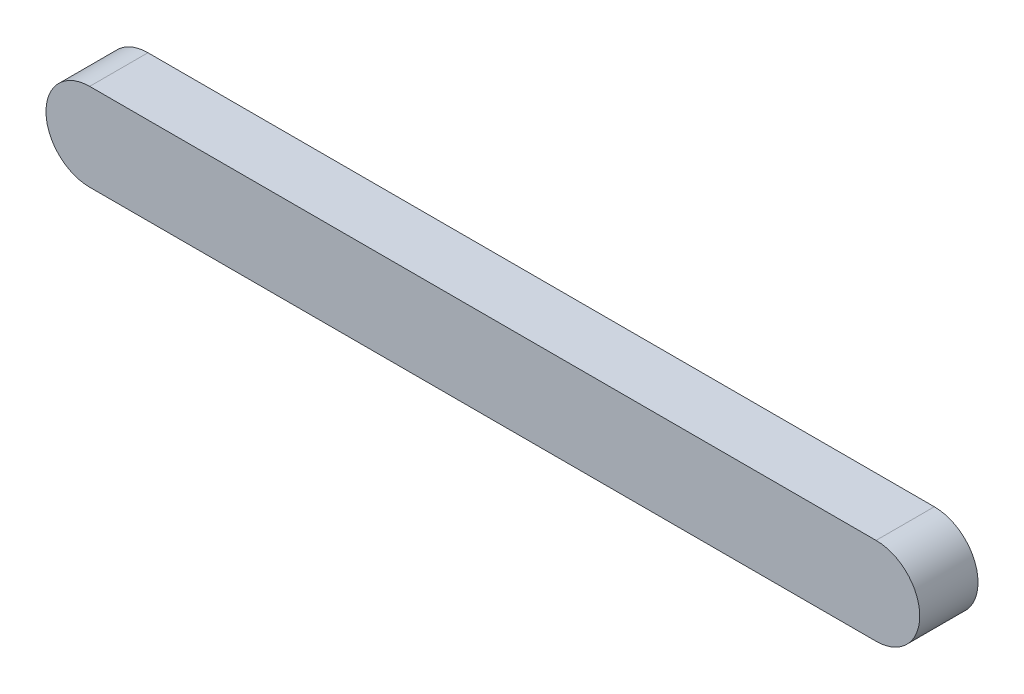
ISO-10303-21;
HEADER;
FILE_DESCRIPTION(('STEP AP214'),'2;1');
FILE_NAME('part.step','',(''),(''),'','','');
FILE_SCHEMA(('AUTOMOTIVE_DESIGN { 1 0 10303 214 1 1 1 1 }'));
ENDSEC;
DATA;
#1=APPLICATION_CONTEXT('core data for automotive mechanical design processes');
#2=APPLICATION_PROTOCOL_DEFINITION('international standard','automotive_design',2000,#1);
#3=PRODUCT_CONTEXT('',#1,'mechanical');
#4=PRODUCT('Part','Part','',(#3));
#5=PRODUCT_RELATED_PRODUCT_CATEGORY('part','',(#4));
#6=PRODUCT_DEFINITION_FORMATION('','',#4);
#7=PRODUCT_DEFINITION_CONTEXT('part definition',#1,'design');
#8=PRODUCT_DEFINITION('design','',#6,#7);
#9=PRODUCT_DEFINITION_SHAPE('','',#8);
#10=(LENGTH_UNIT() NAMED_UNIT(*) SI_UNIT(.MILLI.,.METRE.));
#11=(NAMED_UNIT(*) PLANE_ANGLE_UNIT() SI_UNIT($,.RADIAN.));
#12=(NAMED_UNIT(*) SI_UNIT($,.STERADIAN.) SOLID_ANGLE_UNIT());
#13=UNCERTAINTY_MEASURE_WITH_UNIT(LENGTH_MEASURE(1.E-05),#10,'distance_accuracy_value','');
#14=(GEOMETRIC_REPRESENTATION_CONTEXT(3) GLOBAL_UNCERTAINTY_ASSIGNED_CONTEXT((#13)) GLOBAL_UNIT_ASSIGNED_CONTEXT((#10,
#11,#12)) REPRESENTATION_CONTEXT('',''));
#15=CARTESIAN_POINT('',(0.,0.,0.));
#16=DIRECTION('',(0.,0.,1.));
#17=DIRECTION('',(1.,0.,0.));
#18=AXIS2_PLACEMENT_3D('',#15,#16,#17);
#19=CARTESIAN_POINT('',(0.,0.,10.));
#20=DIRECTION('',(0.,0.,-1.));
#21=DIRECTION('',(-1.,0.,0.));
#22=AXIS2_PLACEMENT_3D('',#19,#20,#21);
#23=CYLINDRICAL_SURFACE('',#22,7.5);
#24=CARTESIAN_POINT('',(0.,0.,0.));
#25=DIRECTION('',(0.,0.,1.));
#26=DIRECTION('',(1.,0.,0.));
#27=AXIS2_PLACEMENT_3D('',#24,#25,#26);
#28=CIRCLE('',#27,7.5);
#29=CARTESIAN_POINT('',(0.,-7.5,0.));
#30=VERTEX_POINT('',#29);
#31=CARTESIAN_POINT('',(0.,7.5,0.));
#32=VERTEX_POINT('',#31);
#33=EDGE_CURVE('E97',#30,#32,#28,.T.);
#34=ORIENTED_EDGE('',*,*,#33,.T.);
#35=DIRECTION('',(0.,0.,-1.));
#36=VECTOR('',#35,1.);
#37=CARTESIAN_POINT('',(0.,7.5,10.));
#38=LINE('',#37,#36);
#39=CARTESIAN_POINT('',(0.,7.5,10.));
#40=VERTEX_POINT('',#39);
#41=EDGE_CURVE('E11',#40,#32,#38,.T.);
#42=ORIENTED_EDGE('',*,*,#41,.F.);
#43=CARTESIAN_POINT('',(0.,0.,10.));
#44=DIRECTION('',(0.,0.,1.));
#45=DIRECTION('',(1.,0.,0.));
#46=AXIS2_PLACEMENT_3D('',#43,#44,#45);
#47=CIRCLE('',#46,7.5);
#48=CARTESIAN_POINT('',(0.,-7.5,10.));
#49=VERTEX_POINT('',#48);
#50=EDGE_CURVE('E85',#49,#40,#47,.T.);
#51=ORIENTED_EDGE('',*,*,#50,.F.);
#52=DIRECTION('',(0.,0.,-1.));
#53=VECTOR('',#52,1.);
#54=CARTESIAN_POINT('',(0.,-7.5,10.));
#55=LINE('',#54,#53);
#56=EDGE_CURVE('E93',#49,#30,#55,.T.);
#57=ORIENTED_EDGE('',*,*,#56,.T.);
#58=EDGE_LOOP('',(#34,#42,#51,#57));
#59=FACE_BOUND('',#58,.T.);
#60=ADVANCED_FACE('F34',(#59),#23,.T.);
#61=CARTESIAN_POINT('',(0.,7.5,10.));
#62=DIRECTION('',(0.,-1.,0.));
#63=DIRECTION('',(1.,0.,0.));
#64=AXIS2_PLACEMENT_3D('',#61,#62,#63);
#65=PLANE('',#64);
#66=DIRECTION('',(-1.,0.,0.));
#67=VECTOR('',#66,1.);
#68=CARTESIAN_POINT('',(0.,7.5,0.));
#69=LINE('',#68,#67);
#70=CARTESIAN_POINT('',(-135.,7.49999999999998,0.));
#71=VERTEX_POINT('',#70);
#72=EDGE_CURVE('E89',#32,#71,#69,.T.);
#73=ORIENTED_EDGE('',*,*,#72,.T.);
#74=DIRECTION('',(0.,0.,-1.));
#75=VECTOR('',#74,1.);
#76=CARTESIAN_POINT('',(-135.,7.49999999999998,10.));
#77=LINE('',#76,#75);
#78=CARTESIAN_POINT('',(-135.,7.49999999999998,10.));
#79=VERTEX_POINT('',#78);
#80=EDGE_CURVE('E42',#79,#71,#77,.T.);
#81=ORIENTED_EDGE('',*,*,#80,.F.);
#82=DIRECTION('',(-1.,0.,0.));
#83=VECTOR('',#82,1.);
#84=CARTESIAN_POINT('',(0.,7.5,10.));
#85=LINE('',#84,#83);
#86=EDGE_CURVE('E80',#40,#79,#85,.T.);
#87=ORIENTED_EDGE('',*,*,#86,.F.);
#88=ORIENTED_EDGE('',*,*,#41,.T.);
#89=EDGE_LOOP('',(#73,#81,#87,#88));
#90=FACE_BOUND('',#89,.T.);
#91=ADVANCED_FACE('F88',(#90),#65,.F.);
#92=CARTESIAN_POINT('',(-135.,0.,10.));
#93=DIRECTION('',(0.,0.,-1.));
#94=DIRECTION('',(-1.,0.,0.));
#95=AXIS2_PLACEMENT_3D('',#92,#93,#94);
#96=CYLINDRICAL_SURFACE('',#95,7.5);
#97=CARTESIAN_POINT('',(-135.,0.,0.));
#98=DIRECTION('',(0.,0.,1.));
#99=DIRECTION('',(1.,0.,0.));
#100=AXIS2_PLACEMENT_3D('',#97,#98,#99);
#101=CIRCLE('',#100,7.5);
#102=CARTESIAN_POINT('',(-135.,-7.50000000000002,0.));
#103=VERTEX_POINT('',#102);
#104=EDGE_CURVE('E67',#71,#103,#101,.T.);
#105=ORIENTED_EDGE('',*,*,#104,.T.);
#106=DIRECTION('',(0.,0.,-1.));
#107=VECTOR('',#106,1.);
#108=CARTESIAN_POINT('',(-135.,-7.50000000000002,10.));
#109=LINE('',#108,#107);
#110=CARTESIAN_POINT('',(-135.,-7.50000000000002,10.));
#111=VERTEX_POINT('',#110);
#112=EDGE_CURVE('E90',#111,#103,#109,.T.);
#113=ORIENTED_EDGE('',*,*,#112,.F.);
#114=CARTESIAN_POINT('',(-135.,0.,10.));
#115=DIRECTION('',(0.,0.,1.));
#116=DIRECTION('',(1.,0.,0.));
#117=AXIS2_PLACEMENT_3D('',#114,#115,#116);
#118=CIRCLE('',#117,7.5);
#119=EDGE_CURVE('E83',#79,#111,#118,.T.);
#120=ORIENTED_EDGE('',*,*,#119,.F.);
#121=ORIENTED_EDGE('',*,*,#80,.T.);
#122=EDGE_LOOP('',(#105,#113,#120,#121));
#123=FACE_BOUND('',#122,.T.);
#124=ADVANCED_FACE('F91',(#123),#96,.T.);
#125=CARTESIAN_POINT('',(0.,-7.5,10.));
#126=DIRECTION('',(0.,1.,0.));
#127=DIRECTION('',(-1.,0.,0.));
#128=AXIS2_PLACEMENT_3D('',#125,#126,#127);
#129=PLANE('',#128);
#130=DIRECTION('',(1.,0.,0.));
#131=VECTOR('',#130,1.);
#132=CARTESIAN_POINT('',(0.,-7.5,0.));
#133=LINE('',#132,#131);
#134=EDGE_CURVE('E73',#103,#30,#133,.T.);
#135=ORIENTED_EDGE('',*,*,#134,.T.);
#136=ORIENTED_EDGE('',*,*,#56,.F.);
#137=DIRECTION('',(1.,0.,0.));
#138=VECTOR('',#137,1.);
#139=CARTESIAN_POINT('',(0.,-7.5,10.));
#140=LINE('',#139,#138);
#141=EDGE_CURVE('E50',#111,#49,#140,.T.);
#142=ORIENTED_EDGE('',*,*,#141,.F.);
#143=ORIENTED_EDGE('',*,*,#112,.T.);
#144=EDGE_LOOP('',(#135,#136,#142,#143));
#145=FACE_BOUND('',#144,.T.);
#146=ADVANCED_FACE('F104',(#145),#129,.F.);
#147=CARTESIAN_POINT('',(0.,0.,10.));
#148=DIRECTION('',(0.,0.,1.));
#149=DIRECTION('',(1.,0.,0.));
#150=AXIS2_PLACEMENT_3D('',#147,#148,#149);
#151=PLANE('',#150);
#152=ORIENTED_EDGE('',*,*,#50,.T.);
#153=ORIENTED_EDGE('',*,*,#86,.T.);
#154=ORIENTED_EDGE('',*,*,#119,.T.);
#155=ORIENTED_EDGE('',*,*,#141,.T.);
#156=EDGE_LOOP('',(#152,#153,#154,#155));
#157=FACE_BOUND('',#156,.T.);
#158=ADVANCED_FACE('F81',(#157),#151,.T.);
#159=CARTESIAN_POINT('',(0.,0.,0.));
#160=DIRECTION('',(0.,0.,1.));
#161=DIRECTION('',(1.,0.,0.));
#162=AXIS2_PLACEMENT_3D('',#159,#160,#161);
#163=PLANE('',#162);
#164=ORIENTED_EDGE('',*,*,#33,.F.);
#165=ORIENTED_EDGE('',*,*,#134,.F.);
#166=ORIENTED_EDGE('',*,*,#104,.F.);
#167=ORIENTED_EDGE('',*,*,#72,.F.);
#168=EDGE_LOOP('',(#164,#165,#166,#167));
#169=FACE_BOUND('',#168,.T.);
#170=ADVANCED_FACE('F107',(#169),#163,.F.);
#171=CLOSED_SHELL('',(#60,#91,#124,#146,#158,#170));
#172=MANIFOLD_SOLID_BREP('B2',#171);
#173=ADVANCED_BREP_SHAPE_REPRESENTATION('',(#18,#172),#14);
#174=SHAPE_DEFINITION_REPRESENTATION(#9,#173);
ENDSEC;
END-ISO-10303-21;
